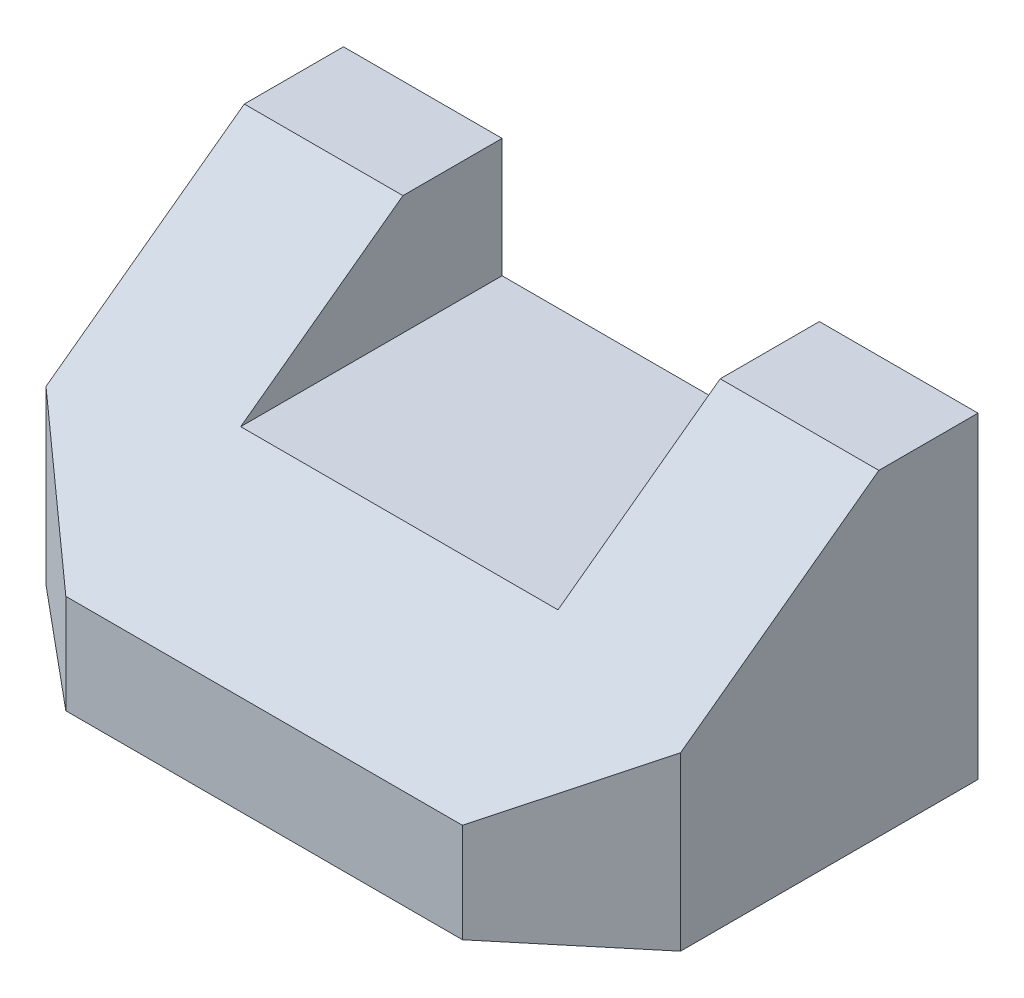
ISO-10303-21;
HEADER;
FILE_DESCRIPTION(('STEP AP214'),'2;1');
FILE_NAME('part.step','',(''),(''),'','','');
FILE_SCHEMA(('AUTOMOTIVE_DESIGN { 1 0 10303 214 1 1 1 1 }'));
ENDSEC;
DATA;
#1=APPLICATION_CONTEXT('core data for automotive mechanical design processes');
#2=APPLICATION_PROTOCOL_DEFINITION('international standard','automotive_design',2000,#1);
#3=PRODUCT_CONTEXT('',#1,'mechanical');
#4=PRODUCT('Part','Part','',(#3));
#5=PRODUCT_RELATED_PRODUCT_CATEGORY('part','',(#4));
#6=PRODUCT_DEFINITION_FORMATION('','',#4);
#7=PRODUCT_DEFINITION_CONTEXT('part definition',#1,'design');
#8=PRODUCT_DEFINITION('design','',#6,#7);
#9=PRODUCT_DEFINITION_SHAPE('','',#8);
#10=(LENGTH_UNIT() NAMED_UNIT(*) SI_UNIT(.MILLI.,.METRE.));
#11=(NAMED_UNIT(*) PLANE_ANGLE_UNIT() SI_UNIT($,.RADIAN.));
#12=(NAMED_UNIT(*) SI_UNIT($,.STERADIAN.) SOLID_ANGLE_UNIT());
#13=UNCERTAINTY_MEASURE_WITH_UNIT(LENGTH_MEASURE(1.E-05),#10,'distance_accuracy_value','');
#14=(GEOMETRIC_REPRESENTATION_CONTEXT(3) GLOBAL_UNCERTAINTY_ASSIGNED_CONTEXT((#13)) GLOBAL_UNIT_ASSIGNED_CONTEXT((#10,
#11,#12)) REPRESENTATION_CONTEXT('',''));
#15=CARTESIAN_POINT('',(0.,0.,0.));
#16=DIRECTION('',(0.,0.,1.));
#17=DIRECTION('',(1.,0.,0.));
#18=AXIS2_PLACEMENT_3D('',#15,#16,#17);
#19=CARTESIAN_POINT('',(50.8,0.,63.5));
#20=DIRECTION('',(-1.,0.,0.));
#21=DIRECTION('',(0.,0.,1.));
#22=AXIS2_PLACEMENT_3D('',#19,#20,#21);
#23=PLANE('',#22);
#24=DIRECTION('',(0.,0.591363663627517,-0.806404995855706));
#25=VECTOR('',#24,1.);
#26=CARTESIAN_POINT('',(50.8,50.8,15.875));
#27=LINE('',#26,#25);
#28=CARTESIAN_POINT('',(50.8,27.5166666666667,47.625));
#29=VERTEX_POINT('',#28);
#30=CARTESIAN_POINT('',(50.8,50.8,15.875));
#31=VERTEX_POINT('',#30);
#32=EDGE_CURVE('E185',#29,#31,#27,.T.);
#33=ORIENTED_EDGE('',*,*,#32,.F.);
#34=DIRECTION('',(0.,-1.,0.));
#35=VECTOR('',#34,1.);
#36=CARTESIAN_POINT('',(50.8,63.5,47.625));
#37=LINE('',#36,#35);
#38=CARTESIAN_POINT('',(50.8,0.,47.625));
#39=VERTEX_POINT('',#38);
#40=EDGE_CURVE('E47',#29,#39,#37,.T.);
#41=ORIENTED_EDGE('',*,*,#40,.T.);
#42=DIRECTION('',(0.,0.,-1.));
#43=VECTOR('',#42,1.);
#44=CARTESIAN_POINT('',(50.8,0.,63.5));
#45=LINE('',#44,#43);
#46=CARTESIAN_POINT('',(50.8,0.,0.));
#47=VERTEX_POINT('',#46);
#48=EDGE_CURVE('E128',#39,#47,#45,.T.);
#49=ORIENTED_EDGE('',*,*,#48,.T.);
#50=DIRECTION('',(0.,1.,0.));
#51=VECTOR('',#50,1.);
#52=CARTESIAN_POINT('',(50.8,0.,0.));
#53=LINE('',#52,#51);
#54=CARTESIAN_POINT('',(50.8,50.8,0.));
#55=VERTEX_POINT('',#54);
#56=EDGE_CURVE('E141',#47,#55,#53,.T.);
#57=ORIENTED_EDGE('',*,*,#56,.T.);
#58=DIRECTION('',(0.,0.,-1.));
#59=VECTOR('',#58,1.);
#60=CARTESIAN_POINT('',(50.8,50.8,63.5));
#61=LINE('',#60,#59);
#62=EDGE_CURVE('E172',#31,#55,#61,.T.);
#63=ORIENTED_EDGE('',*,*,#62,.F.);
#64=EDGE_LOOP('',(#33,#41,#49,#57,#63));
#65=FACE_BOUND('',#64,.T.);
#66=ADVANCED_FACE('F33',(#65),#23,.F.);
#67=CARTESIAN_POINT('',(50.8,50.8,63.5));
#68=DIRECTION('',(0.,-1.,0.));
#69=DIRECTION('',(0.,0.,-1.));
#70=AXIS2_PLACEMENT_3D('',#67,#68,#69);
#71=PLANE('',#70);
#72=DIRECTION('',(0.,0.,-1.));
#73=VECTOR('',#72,1.);
#74=CARTESIAN_POINT('',(25.4,50.8,63.5));
#75=LINE('',#74,#73);
#76=CARTESIAN_POINT('',(25.4,50.8,15.875));
#77=VERTEX_POINT('',#76);
#78=CARTESIAN_POINT('',(25.4,50.8,0.));
#79=VERTEX_POINT('',#78);
#80=EDGE_CURVE('E170',#77,#79,#75,.T.);
#81=ORIENTED_EDGE('',*,*,#80,.F.);
#82=DIRECTION('',(1.,0.,0.));
#83=VECTOR('',#82,1.);
#84=CARTESIAN_POINT('',(-50.8,50.8,15.875));
#85=LINE('',#84,#83);
#86=EDGE_CURVE('E180',#77,#31,#85,.T.);
#87=ORIENTED_EDGE('',*,*,#86,.T.);
#88=ORIENTED_EDGE('',*,*,#62,.T.);
#89=DIRECTION('',(-1.,0.,0.));
#90=VECTOR('',#89,1.);
#91=CARTESIAN_POINT('',(50.8,50.8,0.));
#92=LINE('',#91,#90);
#93=EDGE_CURVE('E144',#55,#79,#92,.T.);
#94=ORIENTED_EDGE('',*,*,#93,.T.);
#95=EDGE_LOOP('',(#81,#87,#88,#94));
#96=FACE_BOUND('',#95,.T.);
#97=ADVANCED_FACE('F201',(#96),#71,.F.);
#98=CARTESIAN_POINT('',(25.4,50.8,63.5));
#99=DIRECTION('',(1.,0.,0.));
#100=DIRECTION('',(0.,0.,-1.));
#101=AXIS2_PLACEMENT_3D('',#98,#99,#100);
#102=PLANE('',#101);
#103=DIRECTION('',(0.,0.,-1.));
#104=VECTOR('',#103,1.);
#105=CARTESIAN_POINT('',(25.4,31.75,63.5));
#106=LINE('',#105,#104);
#107=CARTESIAN_POINT('',(25.4,31.75,41.8522727272727));
#108=VERTEX_POINT('',#107);
#109=CARTESIAN_POINT('',(25.4,31.75,0.));
#110=VERTEX_POINT('',#109);
#111=EDGE_CURVE('E168',#108,#110,#106,.T.);
#112=ORIENTED_EDGE('',*,*,#111,.F.);
#113=DIRECTION('',(0.,0.591363663627517,-0.806404995855706));
#114=VECTOR('',#113,1.);
#115=CARTESIAN_POINT('',(25.4,28.0886560693641,46.8450144508671));
#116=LINE('',#115,#114);
#117=EDGE_CURVE('E139',#108,#77,#116,.T.);
#118=ORIENTED_EDGE('',*,*,#117,.T.);
#119=ORIENTED_EDGE('',*,*,#80,.T.);
#120=DIRECTION('',(0.,-1.,0.));
#121=VECTOR('',#120,1.);
#122=CARTESIAN_POINT('',(25.4,50.8,0.));
#123=LINE('',#122,#121);
#124=EDGE_CURVE('E147',#79,#110,#123,.T.);
#125=ORIENTED_EDGE('',*,*,#124,.T.);
#126=EDGE_LOOP('',(#112,#118,#119,#125));
#127=FACE_BOUND('',#126,.T.);
#128=ADVANCED_FACE('F199',(#127),#102,.F.);
#129=CARTESIAN_POINT('',(25.4,31.75,63.5));
#130=DIRECTION('',(0.,-1.,0.));
#131=DIRECTION('',(0.,0.,-1.));
#132=AXIS2_PLACEMENT_3D('',#129,#130,#131);
#133=PLANE('',#132);
#134=DIRECTION('',(0.,0.,-1.));
#135=VECTOR('',#134,1.);
#136=CARTESIAN_POINT('',(-25.4,31.75,63.5));
#137=LINE('',#136,#135);
#138=CARTESIAN_POINT('',(-25.4,31.75,41.8522727272727));
#139=VERTEX_POINT('',#138);
#140=CARTESIAN_POINT('',(-25.4,31.75,0.));
#141=VERTEX_POINT('',#140);
#142=EDGE_CURVE('E166',#139,#141,#137,.T.);
#143=ORIENTED_EDGE('',*,*,#142,.F.);
#144=DIRECTION('',(1.,0.,0.));
#145=VECTOR('',#144,1.);
#146=CARTESIAN_POINT('',(25.4,31.75,41.8522727272727));
#147=LINE('',#146,#145);
#148=EDGE_CURVE('E191',#139,#108,#147,.T.);
#149=ORIENTED_EDGE('',*,*,#148,.T.);
#150=ORIENTED_EDGE('',*,*,#111,.T.);
#151=DIRECTION('',(-1.,0.,0.));
#152=VECTOR('',#151,1.);
#153=CARTESIAN_POINT('',(25.4,31.75,0.));
#154=LINE('',#153,#152);
#155=EDGE_CURVE('E150',#110,#141,#154,.T.);
#156=ORIENTED_EDGE('',*,*,#155,.T.);
#157=EDGE_LOOP('',(#143,#149,#150,#156));
#158=FACE_BOUND('',#157,.T.);
#159=ADVANCED_FACE('F211',(#158),#133,.F.);
#160=CARTESIAN_POINT('',(-25.4,50.8,63.5));
#161=DIRECTION('',(-1.,0.,0.));
#162=DIRECTION('',(0.,0.,1.));
#163=AXIS2_PLACEMENT_3D('',#160,#161,#162);
#164=PLANE('',#163);
#165=DIRECTION('',(0.,0.,-1.));
#166=VECTOR('',#165,1.);
#167=CARTESIAN_POINT('',(-25.4,50.8,63.5));
#168=LINE('',#167,#166);
#169=CARTESIAN_POINT('',(-25.4,50.8,15.875));
#170=VERTEX_POINT('',#169);
#171=CARTESIAN_POINT('',(-25.4,50.8,0.));
#172=VERTEX_POINT('',#171);
#173=EDGE_CURVE('E164',#170,#172,#168,.T.);
#174=ORIENTED_EDGE('',*,*,#173,.F.);
#175=DIRECTION('',(0.,-0.591363663627517,0.806404995855706));
#176=VECTOR('',#175,1.);
#177=CARTESIAN_POINT('',(-25.4,28.0886560693641,46.8450144508671));
#178=LINE('',#177,#176);
#179=EDGE_CURVE('E189',#170,#139,#178,.T.);
#180=ORIENTED_EDGE('',*,*,#179,.T.);
#181=ORIENTED_EDGE('',*,*,#142,.T.);
#182=DIRECTION('',(0.,1.,0.));
#183=VECTOR('',#182,1.);
#184=CARTESIAN_POINT('',(-25.4,50.8,0.));
#185=LINE('',#184,#183);
#186=EDGE_CURVE('E153',#141,#172,#185,.T.);
#187=ORIENTED_EDGE('',*,*,#186,.T.);
#188=EDGE_LOOP('',(#174,#180,#181,#187));
#189=FACE_BOUND('',#188,.T.);
#190=ADVANCED_FACE('F214',(#189),#164,.F.);
#191=CARTESIAN_POINT('',(-50.8,50.8,63.5));
#192=DIRECTION('',(0.,-1.,0.));
#193=DIRECTION('',(0.,0.,-1.));
#194=AXIS2_PLACEMENT_3D('',#191,#192,#193);
#195=PLANE('',#194);
#196=DIRECTION('',(0.,0.,-1.));
#197=VECTOR('',#196,1.);
#198=CARTESIAN_POINT('',(-50.8,50.8,63.5));
#199=LINE('',#198,#197);
#200=CARTESIAN_POINT('',(-50.8,50.8,15.875));
#201=VERTEX_POINT('',#200);
#202=CARTESIAN_POINT('',(-50.8,50.8,0.));
#203=VERTEX_POINT('',#202);
#204=EDGE_CURVE('E162',#201,#203,#199,.T.);
#205=ORIENTED_EDGE('',*,*,#204,.F.);
#206=EDGE_CURVE('E183',#201,#170,#85,.T.);
#207=ORIENTED_EDGE('',*,*,#206,.T.);
#208=ORIENTED_EDGE('',*,*,#173,.T.);
#209=DIRECTION('',(-1.,0.,0.));
#210=VECTOR('',#209,1.);
#211=CARTESIAN_POINT('',(-50.8,50.8,0.));
#212=LINE('',#211,#210);
#213=EDGE_CURVE('E156',#172,#203,#212,.T.);
#214=ORIENTED_EDGE('',*,*,#213,.T.);
#215=EDGE_LOOP('',(#205,#207,#208,#214));
#216=FACE_BOUND('',#215,.T.);
#217=ADVANCED_FACE('F218',(#216),#195,.F.);
#218=CARTESIAN_POINT('',(-50.8,0.,63.5));
#219=DIRECTION('',(1.,0.,0.));
#220=DIRECTION('',(0.,0.,-1.));
#221=AXIS2_PLACEMENT_3D('',#218,#219,#220);
#222=PLANE('',#221);
#223=DIRECTION('',(0.,0.,-1.));
#224=VECTOR('',#223,1.);
#225=CARTESIAN_POINT('',(-50.8,0.,63.5));
#226=LINE('',#225,#224);
#227=CARTESIAN_POINT('',(-50.8,0.,47.625));
#228=VERTEX_POINT('',#227);
#229=CARTESIAN_POINT('',(-50.8,0.,0.));
#230=VERTEX_POINT('',#229);
#231=EDGE_CURVE('E133',#228,#230,#226,.T.);
#232=ORIENTED_EDGE('',*,*,#231,.F.);
#233=DIRECTION('',(0.,-1.,0.));
#234=VECTOR('',#233,1.);
#235=CARTESIAN_POINT('',(-50.8,63.5,47.625));
#236=LINE('',#235,#234);
#237=CARTESIAN_POINT('',(-50.8,27.5166666666667,47.625));
#238=VERTEX_POINT('',#237);
#239=EDGE_CURVE('E224',#238,#228,#236,.T.);
#240=ORIENTED_EDGE('',*,*,#239,.F.);
#241=DIRECTION('',(0.,0.591363663627517,-0.806404995855706));
#242=VECTOR('',#241,1.);
#243=CARTESIAN_POINT('',(-50.8,50.8,15.875));
#244=LINE('',#243,#242);
#245=EDGE_CURVE('E178',#238,#201,#244,.T.);
#246=ORIENTED_EDGE('',*,*,#245,.T.);
#247=ORIENTED_EDGE('',*,*,#204,.T.);
#248=DIRECTION('',(0.,-1.,0.));
#249=VECTOR('',#248,1.);
#250=CARTESIAN_POINT('',(-50.8,0.,0.));
#251=LINE('',#250,#249);
#252=EDGE_CURVE('E135',#203,#230,#251,.T.);
#253=ORIENTED_EDGE('',*,*,#252,.T.);
#254=EDGE_LOOP('',(#232,#240,#246,#247,#253));
#255=FACE_BOUND('',#254,.T.);
#256=ADVANCED_FACE('F222',(#255),#222,.F.);
#257=CARTESIAN_POINT('',(-50.8,0.,63.5));
#258=DIRECTION('',(0.,1.,0.));
#259=DIRECTION('',(0.,0.,1.));
#260=AXIS2_PLACEMENT_3D('',#257,#258,#259);
#261=PLANE('',#260);
#262=ORIENTED_EDGE('',*,*,#48,.F.);
#263=DIRECTION('',(0.768221279597376,0.,-0.64018439966448));
#264=VECTOR('',#263,1.);
#265=CARTESIAN_POINT('',(50.8,0.,47.625));
#266=LINE('',#265,#264);
#267=CARTESIAN_POINT('',(31.75,0.,63.5));
#268=VERTEX_POINT('',#267);
#269=EDGE_CURVE('E115',#268,#39,#266,.T.);
#270=ORIENTED_EDGE('',*,*,#269,.F.);
#271=DIRECTION('',(1.,0.,0.));
#272=VECTOR('',#271,1.);
#273=CARTESIAN_POINT('',(-50.8,0.,63.5));
#274=LINE('',#273,#272);
#275=CARTESIAN_POINT('',(-31.75,0.,63.5));
#276=VERTEX_POINT('',#275);
#277=EDGE_CURVE('E126',#276,#268,#274,.T.);
#278=ORIENTED_EDGE('',*,*,#277,.F.);
#279=DIRECTION('',(0.768221279597376,0.,0.64018439966448));
#280=VECTOR('',#279,1.);
#281=CARTESIAN_POINT('',(-50.8,0.,47.625));
#282=LINE('',#281,#280);
#283=EDGE_CURVE('E225',#228,#276,#282,.T.);
#284=ORIENTED_EDGE('',*,*,#283,.F.);
#285=ORIENTED_EDGE('',*,*,#231,.T.);
#286=DIRECTION('',(1.,0.,0.));
#287=VECTOR('',#286,1.);
#288=CARTESIAN_POINT('',(-50.8,0.,0.));
#289=LINE('',#288,#287);
#290=EDGE_CURVE('E131',#230,#47,#289,.T.);
#291=ORIENTED_EDGE('',*,*,#290,.T.);
#292=EDGE_LOOP('',(#262,#270,#278,#284,#285,#291));
#293=FACE_BOUND('',#292,.T.);
#294=ADVANCED_FACE('F124',(#293),#261,.F.);
#295=CARTESIAN_POINT('',(0.,0.,63.5));
#296=DIRECTION('',(0.,0.,1.));
#297=DIRECTION('',(1.,0.,0.));
#298=AXIS2_PLACEMENT_3D('',#295,#296,#297);
#299=PLANE('',#298);
#300=DIRECTION('',(0.,-1.,0.));
#301=VECTOR('',#300,1.);
#302=CARTESIAN_POINT('',(31.75,63.5,63.5));
#303=LINE('',#302,#301);
#304=CARTESIAN_POINT('',(31.75,15.875,63.5));
#305=VERTEX_POINT('',#304);
#306=EDGE_CURVE('E112',#305,#268,#303,.T.);
#307=ORIENTED_EDGE('',*,*,#306,.F.);
#308=DIRECTION('',(1.,0.,0.));
#309=VECTOR('',#308,1.);
#310=CARTESIAN_POINT('',(-50.8,15.875,63.5));
#311=LINE('',#310,#309);
#312=CARTESIAN_POINT('',(-31.75,15.875,63.5));
#313=VERTEX_POINT('',#312);
#314=EDGE_CURVE('E176',#313,#305,#311,.T.);
#315=ORIENTED_EDGE('',*,*,#314,.F.);
#316=DIRECTION('',(0.,-1.,0.));
#317=VECTOR('',#316,1.);
#318=CARTESIAN_POINT('',(-31.75,63.5,63.5));
#319=LINE('',#318,#317);
#320=EDGE_CURVE('E54',#313,#276,#319,.T.);
#321=ORIENTED_EDGE('',*,*,#320,.T.);
#322=ORIENTED_EDGE('',*,*,#277,.T.);
#323=EDGE_LOOP('',(#307,#315,#321,#322));
#324=FACE_BOUND('',#323,.T.);
#325=ADVANCED_FACE('F130',(#324),#299,.T.);
#326=CARTESIAN_POINT('',(0.,0.,0.));
#327=DIRECTION('',(0.,0.,1.));
#328=DIRECTION('',(1.,0.,0.));
#329=AXIS2_PLACEMENT_3D('',#326,#327,#328);
#330=PLANE('',#329);
#331=ORIENTED_EDGE('',*,*,#56,.F.);
#332=ORIENTED_EDGE('',*,*,#290,.F.);
#333=ORIENTED_EDGE('',*,*,#252,.F.);
#334=ORIENTED_EDGE('',*,*,#213,.F.);
#335=ORIENTED_EDGE('',*,*,#186,.F.);
#336=ORIENTED_EDGE('',*,*,#155,.F.);
#337=ORIENTED_EDGE('',*,*,#124,.F.);
#338=ORIENTED_EDGE('',*,*,#93,.F.);
#339=EDGE_LOOP('',(#331,#332,#333,#334,#335,#336,#337,#338));
#340=FACE_BOUND('',#339,.T.);
#341=ADVANCED_FACE('F208',(#340),#330,.F.);
#342=CARTESIAN_POINT('',(-50.8,50.8,15.875));
#343=DIRECTION('',(0.,-0.806404995855706,-0.591363663627517));
#344=DIRECTION('',(0.,0.591363663627517,-0.806404995855706));
#345=AXIS2_PLACEMENT_3D('',#342,#343,#344);
#346=PLANE('',#345);
#347=ORIENTED_EDGE('',*,*,#314,.T.);
#348=DIRECTION('',(0.69540066835763,0.424967075107441,-0.579500556964692));
#349=VECTOR('',#348,1.);
#350=CARTESIAN_POINT('',(21.3435820895522,9.51552238805969,72.1720149253731));
#351=LINE('',#350,#349);
#352=EDGE_CURVE('E11',#305,#29,#351,.T.);
#353=ORIENTED_EDGE('',*,*,#352,.T.);
#354=ORIENTED_EDGE('',*,*,#32,.T.);
#355=ORIENTED_EDGE('',*,*,#86,.F.);
#356=ORIENTED_EDGE('',*,*,#117,.F.);
#357=ORIENTED_EDGE('',*,*,#148,.F.);
#358=ORIENTED_EDGE('',*,*,#179,.F.);
#359=ORIENTED_EDGE('',*,*,#206,.F.);
#360=ORIENTED_EDGE('',*,*,#245,.F.);
#361=DIRECTION('',(0.69540066835763,-0.424967075107441,0.579500556964692));
#362=VECTOR('',#361,1.);
#363=CARTESIAN_POINT('',(-70.4755223880597,39.5405970149254,31.2287313432836));
#364=LINE('',#363,#362);
#365=EDGE_CURVE('E40',#238,#313,#364,.T.);
#366=ORIENTED_EDGE('',*,*,#365,.T.);
#367=EDGE_LOOP('',(#347,#353,#354,#355,#356,#357,#358,#359,#360,#366));
#368=FACE_BOUND('',#367,.T.);
#369=ADVANCED_FACE('F175',(#368),#346,.F.);
#370=CARTESIAN_POINT('',(-50.8,63.5,47.625));
#371=DIRECTION('',(0.64018439966448,0.,-0.768221279597376));
#372=DIRECTION('',(-0.768221279597376,0.,-0.64018439966448));
#373=AXIS2_PLACEMENT_3D('',#370,#371,#372);
#374=PLANE('',#373);
#375=ORIENTED_EDGE('',*,*,#239,.T.);
#376=ORIENTED_EDGE('',*,*,#283,.T.);
#377=ORIENTED_EDGE('',*,*,#320,.F.);
#378=ORIENTED_EDGE('',*,*,#365,.F.);
#379=EDGE_LOOP('',(#375,#376,#377,#378));
#380=FACE_BOUND('',#379,.T.);
#381=ADVANCED_FACE('F231',(#380),#374,.F.);
#382=CARTESIAN_POINT('',(50.8,63.5,47.625));
#383=DIRECTION('',(-0.64018439966448,0.,-0.768221279597376));
#384=DIRECTION('',(-0.768221279597376,0.,0.64018439966448));
#385=AXIS2_PLACEMENT_3D('',#382,#383,#384);
#386=PLANE('',#385);
#387=ORIENTED_EDGE('',*,*,#306,.T.);
#388=ORIENTED_EDGE('',*,*,#269,.T.);
#389=ORIENTED_EDGE('',*,*,#40,.F.);
#390=ORIENTED_EDGE('',*,*,#352,.F.);
#391=EDGE_LOOP('',(#387,#388,#389,#390));
#392=FACE_BOUND('',#391,.T.);
#393=ADVANCED_FACE('F114',(#392),#386,.F.);
#394=CLOSED_SHELL('',(#66,#97,#128,#159,#190,#217,#256,#294,#325,#341,#369,#381,#393));
#395=MANIFOLD_SOLID_BREP('B2',#394);
#396=ADVANCED_BREP_SHAPE_REPRESENTATION('',(#18,#395),#14);
#397=SHAPE_DEFINITION_REPRESENTATION(#9,#396);
ENDSEC;
END-ISO-10303-21;
